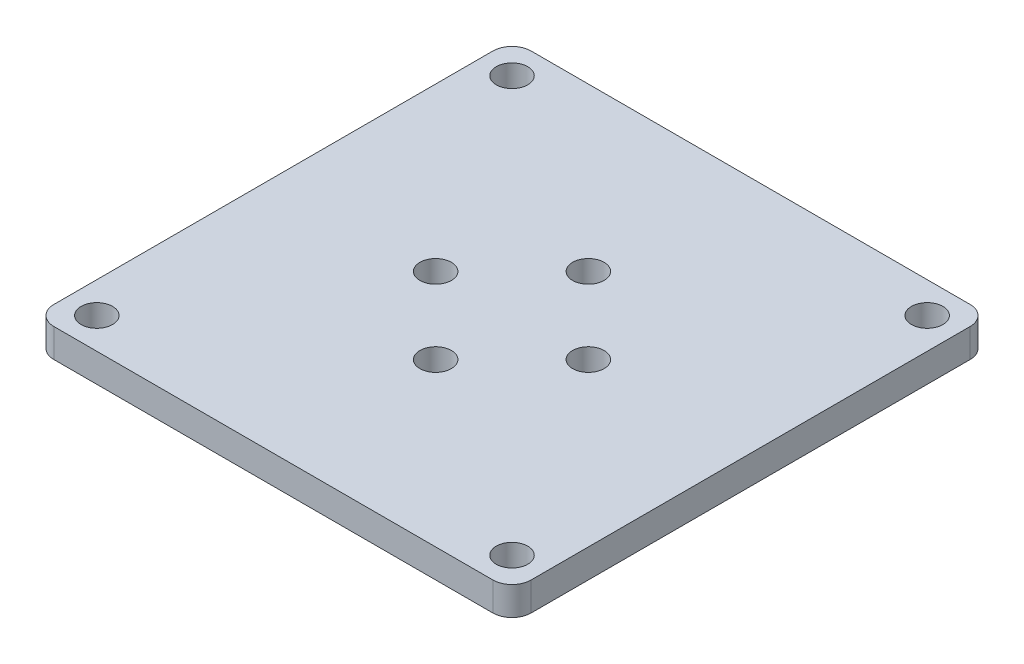
ISO-10303-21;
HEADER;
FILE_DESCRIPTION(('STEP AP214'),'2;1');
FILE_NAME('part.step','',(''),(''),'','','');
FILE_SCHEMA(('AUTOMOTIVE_DESIGN { 1 0 10303 214 1 1 1 1 }'));
ENDSEC;
DATA;
#1=APPLICATION_CONTEXT('core data for automotive mechanical design processes');
#2=APPLICATION_PROTOCOL_DEFINITION('international standard','automotive_design',2000,#1);
#3=PRODUCT_CONTEXT('',#1,'mechanical');
#4=PRODUCT('Part','Part','',(#3));
#5=PRODUCT_RELATED_PRODUCT_CATEGORY('part','',(#4));
#6=PRODUCT_DEFINITION_FORMATION('','',#4);
#7=PRODUCT_DEFINITION_CONTEXT('part definition',#1,'design');
#8=PRODUCT_DEFINITION('design','',#6,#7);
#9=PRODUCT_DEFINITION_SHAPE('','',#8);
#10=(LENGTH_UNIT() NAMED_UNIT(*) SI_UNIT(.MILLI.,.METRE.));
#11=(NAMED_UNIT(*) PLANE_ANGLE_UNIT() SI_UNIT($,.RADIAN.));
#12=(NAMED_UNIT(*) SI_UNIT($,.STERADIAN.) SOLID_ANGLE_UNIT());
#13=UNCERTAINTY_MEASURE_WITH_UNIT(LENGTH_MEASURE(1.E-05),#10,'distance_accuracy_value','');
#14=(GEOMETRIC_REPRESENTATION_CONTEXT(3) GLOBAL_UNCERTAINTY_ASSIGNED_CONTEXT((#13)) GLOBAL_UNIT_ASSIGNED_CONTEXT((#10,
#11,#12)) REPRESENTATION_CONTEXT('',''));
#15=CARTESIAN_POINT('',(0.,0.,0.));
#16=DIRECTION('',(0.,0.,1.));
#17=DIRECTION('',(1.,0.,0.));
#18=AXIS2_PLACEMENT_3D('',#15,#16,#17);
#19=CARTESIAN_POINT('',(0.,3.,0.));
#20=DIRECTION('',(0.,-1.,0.));
#21=DIRECTION('',(0.,0.,-1.));
#22=AXIS2_PLACEMENT_3D('',#19,#20,#21);
#23=PLANE('',#22);
#24=DIRECTION('',(0.,0.,1.));
#25=VECTOR('',#24,1.);
#26=CARTESIAN_POINT('',(-25.,3.,25.));
#27=LINE('',#26,#25);
#28=CARTESIAN_POINT('',(-25.,3.,-23.));
#29=VERTEX_POINT('',#28);
#30=CARTESIAN_POINT('',(-25.,3.,23.));
#31=VERTEX_POINT('',#30);
#32=EDGE_CURVE('E174',#29,#31,#27,.T.);
#33=ORIENTED_EDGE('',*,*,#32,.T.);
#34=CARTESIAN_POINT('',(-23.,3.,23.));
#35=DIRECTION('',(0.,-1.,0.));
#36=DIRECTION('',(0.,0.,-1.));
#37=AXIS2_PLACEMENT_3D('',#34,#35,#36);
#38=CIRCLE('',#37,2.);
#39=CARTESIAN_POINT('',(-23.,3.,25.));
#40=VERTEX_POINT('',#39);
#41=EDGE_CURVE('E11',#31,#40,#38,.F.);
#42=ORIENTED_EDGE('',*,*,#41,.T.);
#43=DIRECTION('',(1.,0.,0.));
#44=VECTOR('',#43,1.);
#45=CARTESIAN_POINT('',(-25.,3.,25.));
#46=LINE('',#45,#44);
#47=CARTESIAN_POINT('',(23.,3.,25.));
#48=VERTEX_POINT('',#47);
#49=EDGE_CURVE('E122',#40,#48,#46,.T.);
#50=ORIENTED_EDGE('',*,*,#49,.T.);
#51=CARTESIAN_POINT('',(23.,3.,23.));
#52=DIRECTION('',(0.,-1.,0.));
#53=DIRECTION('',(0.,0.,-1.));
#54=AXIS2_PLACEMENT_3D('',#51,#52,#53);
#55=CIRCLE('',#54,2.);
#56=CARTESIAN_POINT('',(25.,3.,23.));
#57=VERTEX_POINT('',#56);
#58=EDGE_CURVE('E144',#48,#57,#55,.F.);
#59=ORIENTED_EDGE('',*,*,#58,.T.);
#60=DIRECTION('',(0.,0.,-1.));
#61=VECTOR('',#60,1.);
#62=CARTESIAN_POINT('',(25.,3.,25.));
#63=LINE('',#62,#61);
#64=CARTESIAN_POINT('',(25.,3.,-23.));
#65=VERTEX_POINT('',#64);
#66=EDGE_CURVE('E121',#57,#65,#63,.T.);
#67=ORIENTED_EDGE('',*,*,#66,.T.);
#68=CARTESIAN_POINT('',(23.,3.,-23.));
#69=DIRECTION('',(0.,-1.,0.));
#70=DIRECTION('',(0.,0.,-1.));
#71=AXIS2_PLACEMENT_3D('',#68,#69,#70);
#72=CIRCLE('',#71,2.);
#73=CARTESIAN_POINT('',(23.,3.,-25.));
#74=VERTEX_POINT('',#73);
#75=EDGE_CURVE('E152',#65,#74,#72,.F.);
#76=ORIENTED_EDGE('',*,*,#75,.T.);
#77=DIRECTION('',(-1.,0.,0.));
#78=VECTOR('',#77,1.);
#79=CARTESIAN_POINT('',(-25.,3.,-25.));
#80=LINE('',#79,#78);
#81=CARTESIAN_POINT('',(-23.,3.,-25.));
#82=VERTEX_POINT('',#81);
#83=EDGE_CURVE('E178',#74,#82,#80,.T.);
#84=ORIENTED_EDGE('',*,*,#83,.T.);
#85=CARTESIAN_POINT('',(-23.,3.,-23.));
#86=DIRECTION('',(0.,-1.,0.));
#87=DIRECTION('',(0.,0.,-1.));
#88=AXIS2_PLACEMENT_3D('',#85,#86,#87);
#89=CIRCLE('',#88,2.);
#90=EDGE_CURVE('E161',#82,#29,#89,.F.);
#91=ORIENTED_EDGE('',*,*,#90,.T.);
#92=EDGE_LOOP('',(#33,#42,#50,#59,#67,#76,#84,#91));
#93=FACE_BOUND('',#92,.T.);
#94=CARTESIAN_POINT('',(21.75,3.,-21.75));
#95=DIRECTION('',(0.,1.,0.));
#96=DIRECTION('',(0.,0.,1.));
#97=AXIS2_PLACEMENT_3D('',#94,#95,#96);
#98=CIRCLE('',#97,1.65);
#99=CARTESIAN_POINT('',(21.75,3.,-20.1));
#100=VERTEX_POINT('',#99);
#101=EDGE_CURVE('E129',#100,#100,#98,.T.);
#102=ORIENTED_EDGE('',*,*,#101,.F.);
#103=EDGE_LOOP('',(#102));
#104=FACE_BOUND('',#103,.T.);
#105=CARTESIAN_POINT('',(-21.75,3.,-21.75));
#106=DIRECTION('',(0.,1.,0.));
#107=DIRECTION('',(0.,0.,1.));
#108=AXIS2_PLACEMENT_3D('',#105,#106,#107);
#109=CIRCLE('',#108,1.65);
#110=CARTESIAN_POINT('',(-21.75,3.,-20.1));
#111=VERTEX_POINT('',#110);
#112=EDGE_CURVE('E183',#111,#111,#109,.T.);
#113=ORIENTED_EDGE('',*,*,#112,.F.);
#114=EDGE_LOOP('',(#113));
#115=FACE_BOUND('',#114,.T.);
#116=CARTESIAN_POINT('',(21.75,3.,21.75));
#117=DIRECTION('',(0.,1.,0.));
#118=DIRECTION('',(0.,0.,1.));
#119=AXIS2_PLACEMENT_3D('',#116,#117,#118);
#120=CIRCLE('',#119,1.65);
#121=CARTESIAN_POINT('',(21.75,3.,23.4));
#122=VERTEX_POINT('',#121);
#123=EDGE_CURVE('E188',#122,#122,#120,.T.);
#124=ORIENTED_EDGE('',*,*,#123,.F.);
#125=EDGE_LOOP('',(#124));
#126=FACE_BOUND('',#125,.T.);
#127=CARTESIAN_POINT('',(-21.75,3.,21.75));
#128=DIRECTION('',(0.,1.,0.));
#129=DIRECTION('',(0.,0.,1.));
#130=AXIS2_PLACEMENT_3D('',#127,#128,#129);
#131=CIRCLE('',#130,1.65);
#132=CARTESIAN_POINT('',(-21.75,3.,23.4));
#133=VERTEX_POINT('',#132);
#134=EDGE_CURVE('E194',#133,#133,#131,.T.);
#135=ORIENTED_EDGE('',*,*,#134,.F.);
#136=EDGE_LOOP('',(#135));
#137=FACE_BOUND('',#136,.T.);
#138=CARTESIAN_POINT('',(8.,3.,0.));
#139=DIRECTION('',(0.,1.,0.));
#140=DIRECTION('',(0.,0.,1.));
#141=AXIS2_PLACEMENT_3D('',#138,#139,#140);
#142=CIRCLE('',#141,1.65);
#143=CARTESIAN_POINT('',(8.,3.,1.65));
#144=VERTEX_POINT('',#143);
#145=EDGE_CURVE('E200',#144,#144,#142,.T.);
#146=ORIENTED_EDGE('',*,*,#145,.F.);
#147=EDGE_LOOP('',(#146));
#148=FACE_BOUND('',#147,.T.);
#149=CARTESIAN_POINT('',(0.,3.,-8.));
#150=DIRECTION('',(0.,1.,0.));
#151=DIRECTION('',(0.,0.,1.));
#152=AXIS2_PLACEMENT_3D('',#149,#150,#151);
#153=CIRCLE('',#152,1.65);
#154=CARTESIAN_POINT('',(0.,3.,-6.35));
#155=VERTEX_POINT('',#154);
#156=EDGE_CURVE('E206',#155,#155,#153,.T.);
#157=ORIENTED_EDGE('',*,*,#156,.F.);
#158=EDGE_LOOP('',(#157));
#159=FACE_BOUND('',#158,.T.);
#160=CARTESIAN_POINT('',(-8.,3.,0.));
#161=DIRECTION('',(0.,1.,0.));
#162=DIRECTION('',(0.,0.,1.));
#163=AXIS2_PLACEMENT_3D('',#160,#161,#162);
#164=CIRCLE('',#163,1.65);
#165=CARTESIAN_POINT('',(-8.,3.,1.65));
#166=VERTEX_POINT('',#165);
#167=EDGE_CURVE('E212',#166,#166,#164,.T.);
#168=ORIENTED_EDGE('',*,*,#167,.F.);
#169=EDGE_LOOP('',(#168));
#170=FACE_BOUND('',#169,.T.);
#171=CARTESIAN_POINT('',(0.,3.,8.));
#172=DIRECTION('',(0.,1.,0.));
#173=DIRECTION('',(0.,0.,1.));
#174=AXIS2_PLACEMENT_3D('',#171,#172,#173);
#175=CIRCLE('',#174,1.65);
#176=CARTESIAN_POINT('',(0.,3.,9.65));
#177=VERTEX_POINT('',#176);
#178=EDGE_CURVE('E218',#177,#177,#175,.T.);
#179=ORIENTED_EDGE('',*,*,#178,.F.);
#180=EDGE_LOOP('',(#179));
#181=FACE_BOUND('',#180,.T.);
#182=ADVANCED_FACE('F39',(#93,#104,#115,#126,#137,#148,#159,#170,#181),#23,.F.);
#183=CARTESIAN_POINT('',(0.,0.,0.));
#184=DIRECTION('',(0.,-1.,0.));
#185=DIRECTION('',(0.,0.,-1.));
#186=AXIS2_PLACEMENT_3D('',#183,#184,#185);
#187=PLANE('',#186);
#188=CARTESIAN_POINT('',(-8.,0.,0.));
#189=DIRECTION('',(0.,1.,0.));
#190=DIRECTION('',(0.,0.,1.));
#191=AXIS2_PLACEMENT_3D('',#188,#189,#190);
#192=CIRCLE('',#191,1.65);
#193=CARTESIAN_POINT('',(-8.,0.,1.65));
#194=VERTEX_POINT('',#193);
#195=EDGE_CURVE('E215',#194,#194,#192,.T.);
#196=ORIENTED_EDGE('',*,*,#195,.T.);
#197=EDGE_LOOP('',(#196));
#198=FACE_BOUND('',#197,.T.);
#199=CARTESIAN_POINT('',(8.,0.,0.));
#200=DIRECTION('',(0.,1.,0.));
#201=DIRECTION('',(0.,0.,1.));
#202=AXIS2_PLACEMENT_3D('',#199,#200,#201);
#203=CIRCLE('',#202,1.65);
#204=CARTESIAN_POINT('',(8.,0.,1.65));
#205=VERTEX_POINT('',#204);
#206=EDGE_CURVE('E203',#205,#205,#203,.T.);
#207=ORIENTED_EDGE('',*,*,#206,.T.);
#208=EDGE_LOOP('',(#207));
#209=FACE_BOUND('',#208,.T.);
#210=CARTESIAN_POINT('',(21.75,0.,21.75));
#211=DIRECTION('',(0.,1.,0.));
#212=DIRECTION('',(0.,0.,1.));
#213=AXIS2_PLACEMENT_3D('',#210,#211,#212);
#214=CIRCLE('',#213,1.65);
#215=CARTESIAN_POINT('',(21.75,0.,23.4));
#216=VERTEX_POINT('',#215);
#217=EDGE_CURVE('E191',#216,#216,#214,.T.);
#218=ORIENTED_EDGE('',*,*,#217,.T.);
#219=EDGE_LOOP('',(#218));
#220=FACE_BOUND('',#219,.T.);
#221=CARTESIAN_POINT('',(21.75,0.,-21.75));
#222=DIRECTION('',(0.,1.,0.));
#223=DIRECTION('',(0.,0.,1.));
#224=AXIS2_PLACEMENT_3D('',#221,#222,#223);
#225=CIRCLE('',#224,1.65);
#226=CARTESIAN_POINT('',(21.75,0.,-20.1));
#227=VERTEX_POINT('',#226);
#228=EDGE_CURVE('E135',#227,#227,#225,.T.);
#229=ORIENTED_EDGE('',*,*,#228,.T.);
#230=EDGE_LOOP('',(#229));
#231=FACE_BOUND('',#230,.T.);
#232=DIRECTION('',(1.,0.,0.));
#233=VECTOR('',#232,1.);
#234=CARTESIAN_POINT('',(-25.,0.,25.));
#235=LINE('',#234,#233);
#236=CARTESIAN_POINT('',(-23.,0.,25.));
#237=VERTEX_POINT('',#236);
#238=CARTESIAN_POINT('',(23.,0.,25.));
#239=VERTEX_POINT('',#238);
#240=EDGE_CURVE('E141',#237,#239,#235,.T.);
#241=ORIENTED_EDGE('',*,*,#240,.F.);
#242=CARTESIAN_POINT('',(-23.,0.,23.));
#243=DIRECTION('',(0.,-1.,0.));
#244=DIRECTION('',(0.,0.,-1.));
#245=AXIS2_PLACEMENT_3D('',#242,#243,#244);
#246=CIRCLE('',#245,2.);
#247=CARTESIAN_POINT('',(-25.,0.,23.));
#248=VERTEX_POINT('',#247);
#249=EDGE_CURVE('E61',#237,#248,#246,.T.);
#250=ORIENTED_EDGE('',*,*,#249,.T.);
#251=DIRECTION('',(0.,0.,1.));
#252=VECTOR('',#251,1.);
#253=CARTESIAN_POINT('',(-25.,0.,25.));
#254=LINE('',#253,#252);
#255=CARTESIAN_POINT('',(-25.,0.,-23.));
#256=VERTEX_POINT('',#255);
#257=EDGE_CURVE('E132',#256,#248,#254,.T.);
#258=ORIENTED_EDGE('',*,*,#257,.F.);
#259=CARTESIAN_POINT('',(-23.,0.,-23.));
#260=DIRECTION('',(0.,-1.,0.));
#261=DIRECTION('',(0.,0.,-1.));
#262=AXIS2_PLACEMENT_3D('',#259,#260,#261);
#263=CIRCLE('',#262,2.);
#264=CARTESIAN_POINT('',(-23.,0.,-25.));
#265=VERTEX_POINT('',#264);
#266=EDGE_CURVE('E157',#256,#265,#263,.T.);
#267=ORIENTED_EDGE('',*,*,#266,.T.);
#268=DIRECTION('',(-1.,0.,0.));
#269=VECTOR('',#268,1.);
#270=CARTESIAN_POINT('',(-25.,0.,-25.));
#271=LINE('',#270,#269);
#272=CARTESIAN_POINT('',(23.,0.,-25.));
#273=VERTEX_POINT('',#272);
#274=EDGE_CURVE('E128',#273,#265,#271,.T.);
#275=ORIENTED_EDGE('',*,*,#274,.F.);
#276=CARTESIAN_POINT('',(23.,0.,-23.));
#277=DIRECTION('',(0.,-1.,0.));
#278=DIRECTION('',(0.,0.,-1.));
#279=AXIS2_PLACEMENT_3D('',#276,#277,#278);
#280=CIRCLE('',#279,2.);
#281=CARTESIAN_POINT('',(25.,0.,-23.));
#282=VERTEX_POINT('',#281);
#283=EDGE_CURVE('E127',#273,#282,#280,.T.);
#284=ORIENTED_EDGE('',*,*,#283,.T.);
#285=DIRECTION('',(0.,0.,-1.));
#286=VECTOR('',#285,1.);
#287=CARTESIAN_POINT('',(25.,0.,25.));
#288=LINE('',#287,#286);
#289=CARTESIAN_POINT('',(25.,0.,23.));
#290=VERTEX_POINT('',#289);
#291=EDGE_CURVE('E118',#290,#282,#288,.T.);
#292=ORIENTED_EDGE('',*,*,#291,.F.);
#293=CARTESIAN_POINT('',(23.,0.,23.));
#294=DIRECTION('',(0.,-1.,0.));
#295=DIRECTION('',(0.,0.,-1.));
#296=AXIS2_PLACEMENT_3D('',#293,#294,#295);
#297=CIRCLE('',#296,2.);
#298=EDGE_CURVE('E105',#290,#239,#297,.T.);
#299=ORIENTED_EDGE('',*,*,#298,.T.);
#300=EDGE_LOOP('',(#241,#250,#258,#267,#275,#284,#292,#299));
#301=FACE_BOUND('',#300,.T.);
#302=CARTESIAN_POINT('',(-21.75,0.,-21.75));
#303=DIRECTION('',(0.,1.,0.));
#304=DIRECTION('',(0.,0.,1.));
#305=AXIS2_PLACEMENT_3D('',#302,#303,#304);
#306=CIRCLE('',#305,1.65);
#307=CARTESIAN_POINT('',(-21.75,0.,-20.1));
#308=VERTEX_POINT('',#307);
#309=EDGE_CURVE('E185',#308,#308,#306,.T.);
#310=ORIENTED_EDGE('',*,*,#309,.T.);
#311=EDGE_LOOP('',(#310));
#312=FACE_BOUND('',#311,.T.);
#313=CARTESIAN_POINT('',(-21.75,0.,21.75));
#314=DIRECTION('',(0.,1.,0.));
#315=DIRECTION('',(0.,0.,1.));
#316=AXIS2_PLACEMENT_3D('',#313,#314,#315);
#317=CIRCLE('',#316,1.65);
#318=CARTESIAN_POINT('',(-21.75,0.,23.4));
#319=VERTEX_POINT('',#318);
#320=EDGE_CURVE('E197',#319,#319,#317,.T.);
#321=ORIENTED_EDGE('',*,*,#320,.T.);
#322=EDGE_LOOP('',(#321));
#323=FACE_BOUND('',#322,.T.);
#324=CARTESIAN_POINT('',(0.,0.,-8.));
#325=DIRECTION('',(0.,1.,0.));
#326=DIRECTION('',(0.,0.,1.));
#327=AXIS2_PLACEMENT_3D('',#324,#325,#326);
#328=CIRCLE('',#327,1.65);
#329=CARTESIAN_POINT('',(0.,0.,-6.35));
#330=VERTEX_POINT('',#329);
#331=EDGE_CURVE('E209',#330,#330,#328,.T.);
#332=ORIENTED_EDGE('',*,*,#331,.T.);
#333=EDGE_LOOP('',(#332));
#334=FACE_BOUND('',#333,.T.);
#335=CARTESIAN_POINT('',(0.,0.,8.));
#336=DIRECTION('',(0.,1.,0.));
#337=DIRECTION('',(0.,0.,1.));
#338=AXIS2_PLACEMENT_3D('',#335,#336,#337);
#339=CIRCLE('',#338,1.65);
#340=CARTESIAN_POINT('',(0.,0.,9.65));
#341=VERTEX_POINT('',#340);
#342=EDGE_CURVE('E221',#341,#341,#339,.T.);
#343=ORIENTED_EDGE('',*,*,#342,.T.);
#344=EDGE_LOOP('',(#343));
#345=FACE_BOUND('',#344,.T.);
#346=ADVANCED_FACE('F124',(#198,#209,#220,#231,#301,#312,#323,#334,#345),#187,.T.);
#347=CARTESIAN_POINT('',(25.,3.,25.));
#348=DIRECTION('',(-1.,0.,0.));
#349=DIRECTION('',(0.,0.,1.));
#350=AXIS2_PLACEMENT_3D('',#347,#348,#349);
#351=PLANE('',#350);
#352=ORIENTED_EDGE('',*,*,#291,.T.);
#353=DIRECTION('',(0.,-1.,0.));
#354=VECTOR('',#353,1.);
#355=CARTESIAN_POINT('',(25.,3.,-23.));
#356=LINE('',#355,#354);
#357=EDGE_CURVE('E150',#282,#65,#356,.F.);
#358=ORIENTED_EDGE('',*,*,#357,.T.);
#359=ORIENTED_EDGE('',*,*,#66,.F.);
#360=DIRECTION('',(0.,-1.,0.));
#361=VECTOR('',#360,1.);
#362=CARTESIAN_POINT('',(25.,3.,23.));
#363=LINE('',#362,#361);
#364=EDGE_CURVE('E109',#57,#290,#363,.T.);
#365=ORIENTED_EDGE('',*,*,#364,.T.);
#366=EDGE_LOOP('',(#352,#358,#359,#365));
#367=FACE_BOUND('',#366,.T.);
#368=ADVANCED_FACE('F117',(#367),#351,.F.);
#369=CARTESIAN_POINT('',(-25.,3.,-25.));
#370=DIRECTION('',(0.,0.,1.));
#371=DIRECTION('',(1.,0.,0.));
#372=AXIS2_PLACEMENT_3D('',#369,#370,#371);
#373=PLANE('',#372);
#374=ORIENTED_EDGE('',*,*,#274,.T.);
#375=DIRECTION('',(0.,-1.,0.));
#376=VECTOR('',#375,1.);
#377=CARTESIAN_POINT('',(-23.,3.,-25.));
#378=LINE('',#377,#376);
#379=EDGE_CURVE('E159',#265,#82,#378,.F.);
#380=ORIENTED_EDGE('',*,*,#379,.T.);
#381=ORIENTED_EDGE('',*,*,#83,.F.);
#382=DIRECTION('',(0.,-1.,0.));
#383=VECTOR('',#382,1.);
#384=CARTESIAN_POINT('',(23.,3.,-25.));
#385=LINE('',#384,#383);
#386=EDGE_CURVE('E146',#74,#273,#385,.T.);
#387=ORIENTED_EDGE('',*,*,#386,.T.);
#388=EDGE_LOOP('',(#374,#380,#381,#387));
#389=FACE_BOUND('',#388,.T.);
#390=ADVANCED_FACE('F246',(#389),#373,.F.);
#391=CARTESIAN_POINT('',(-25.,3.,25.));
#392=DIRECTION('',(1.,0.,0.));
#393=DIRECTION('',(0.,0.,-1.));
#394=AXIS2_PLACEMENT_3D('',#391,#392,#393);
#395=PLANE('',#394);
#396=ORIENTED_EDGE('',*,*,#257,.T.);
#397=DIRECTION('',(0.,-1.,0.));
#398=VECTOR('',#397,1.);
#399=CARTESIAN_POINT('',(-25.,3.,23.));
#400=LINE('',#399,#398);
#401=EDGE_CURVE('E47',#248,#31,#400,.F.);
#402=ORIENTED_EDGE('',*,*,#401,.T.);
#403=ORIENTED_EDGE('',*,*,#32,.F.);
#404=DIRECTION('',(0.,-1.,0.));
#405=VECTOR('',#404,1.);
#406=CARTESIAN_POINT('',(-25.,3.,-23.));
#407=LINE('',#406,#405);
#408=EDGE_CURVE('E154',#29,#256,#407,.T.);
#409=ORIENTED_EDGE('',*,*,#408,.T.);
#410=EDGE_LOOP('',(#396,#402,#403,#409));
#411=FACE_BOUND('',#410,.T.);
#412=ADVANCED_FACE('F243',(#411),#395,.F.);
#413=CARTESIAN_POINT('',(-25.,3.,25.));
#414=DIRECTION('',(0.,0.,-1.));
#415=DIRECTION('',(-1.,0.,0.));
#416=AXIS2_PLACEMENT_3D('',#413,#414,#415);
#417=PLANE('',#416);
#418=ORIENTED_EDGE('',*,*,#49,.F.);
#419=DIRECTION('',(0.,-1.,0.));
#420=VECTOR('',#419,1.);
#421=CARTESIAN_POINT('',(-23.,3.,25.));
#422=LINE('',#421,#420);
#423=EDGE_CURVE('E163',#40,#237,#422,.T.);
#424=ORIENTED_EDGE('',*,*,#423,.T.);
#425=ORIENTED_EDGE('',*,*,#240,.T.);
#426=DIRECTION('',(0.,-1.,0.));
#427=VECTOR('',#426,1.);
#428=CARTESIAN_POINT('',(23.,3.,25.));
#429=LINE('',#428,#427);
#430=EDGE_CURVE('E111',#239,#48,#429,.F.);
#431=ORIENTED_EDGE('',*,*,#430,.T.);
#432=EDGE_LOOP('',(#418,#424,#425,#431));
#433=FACE_BOUND('',#432,.T.);
#434=ADVANCED_FACE('F169',(#433),#417,.F.);
#435=CARTESIAN_POINT('',(21.75,3.,-21.75));
#436=DIRECTION('',(0.,-1.,0.));
#437=DIRECTION('',(0.,0.,-1.));
#438=AXIS2_PLACEMENT_3D('',#435,#436,#437);
#439=CYLINDRICAL_SURFACE('',#438,1.65);
#440=ORIENTED_EDGE('',*,*,#101,.T.);
#441=EDGE_LOOP('',(#440));
#442=FACE_BOUND('',#441,.T.);
#443=ORIENTED_EDGE('',*,*,#228,.F.);
#444=EDGE_LOOP('',(#443));
#445=FACE_BOUND('',#444,.T.);
#446=ADVANCED_FACE('F238',(#442,#445),#439,.F.);
#447=CARTESIAN_POINT('',(-21.75,3.,-21.75));
#448=DIRECTION('',(0.,-1.,0.));
#449=DIRECTION('',(0.,0.,-1.));
#450=AXIS2_PLACEMENT_3D('',#447,#448,#449);
#451=CYLINDRICAL_SURFACE('',#450,1.65);
#452=ORIENTED_EDGE('',*,*,#112,.T.);
#453=EDGE_LOOP('',(#452));
#454=FACE_BOUND('',#453,.T.);
#455=ORIENTED_EDGE('',*,*,#309,.F.);
#456=EDGE_LOOP('',(#455));
#457=FACE_BOUND('',#456,.T.);
#458=ADVANCED_FACE('F394',(#454,#457),#451,.F.);
#459=CARTESIAN_POINT('',(21.75,3.,21.75));
#460=DIRECTION('',(0.,-1.,0.));
#461=DIRECTION('',(0.,0.,-1.));
#462=AXIS2_PLACEMENT_3D('',#459,#460,#461);
#463=CYLINDRICAL_SURFACE('',#462,1.65);
#464=ORIENTED_EDGE('',*,*,#123,.T.);
#465=EDGE_LOOP('',(#464));
#466=FACE_BOUND('',#465,.T.);
#467=ORIENTED_EDGE('',*,*,#217,.F.);
#468=EDGE_LOOP('',(#467));
#469=FACE_BOUND('',#468,.T.);
#470=ADVANCED_FACE('F383',(#466,#469),#463,.F.);
#471=CARTESIAN_POINT('',(-21.75,3.,21.75));
#472=DIRECTION('',(0.,-1.,0.));
#473=DIRECTION('',(0.,0.,-1.));
#474=AXIS2_PLACEMENT_3D('',#471,#472,#473);
#475=CYLINDRICAL_SURFACE('',#474,1.65);
#476=ORIENTED_EDGE('',*,*,#134,.T.);
#477=EDGE_LOOP('',(#476));
#478=FACE_BOUND('',#477,.T.);
#479=ORIENTED_EDGE('',*,*,#320,.F.);
#480=EDGE_LOOP('',(#479));
#481=FACE_BOUND('',#480,.T.);
#482=ADVANCED_FACE('F372',(#478,#481),#475,.F.);
#483=CARTESIAN_POINT('',(8.,3.,0.));
#484=DIRECTION('',(0.,-1.,0.));
#485=DIRECTION('',(0.,0.,-1.));
#486=AXIS2_PLACEMENT_3D('',#483,#484,#485);
#487=CYLINDRICAL_SURFACE('',#486,1.65);
#488=ORIENTED_EDGE('',*,*,#145,.T.);
#489=EDGE_LOOP('',(#488));
#490=FACE_BOUND('',#489,.T.);
#491=ORIENTED_EDGE('',*,*,#206,.F.);
#492=EDGE_LOOP('',(#491));
#493=FACE_BOUND('',#492,.T.);
#494=ADVANCED_FACE('F361',(#490,#493),#487,.F.);
#495=CARTESIAN_POINT('',(0.,3.,-8.));
#496=DIRECTION('',(0.,-1.,0.));
#497=DIRECTION('',(0.,0.,-1.));
#498=AXIS2_PLACEMENT_3D('',#495,#496,#497);
#499=CYLINDRICAL_SURFACE('',#498,1.65);
#500=ORIENTED_EDGE('',*,*,#156,.T.);
#501=EDGE_LOOP('',(#500));
#502=FACE_BOUND('',#501,.T.);
#503=ORIENTED_EDGE('',*,*,#331,.F.);
#504=EDGE_LOOP('',(#503));
#505=FACE_BOUND('',#504,.T.);
#506=ADVANCED_FACE('F350',(#502,#505),#499,.F.);
#507=CARTESIAN_POINT('',(-8.,3.,0.));
#508=DIRECTION('',(0.,-1.,0.));
#509=DIRECTION('',(0.,0.,-1.));
#510=AXIS2_PLACEMENT_3D('',#507,#508,#509);
#511=CYLINDRICAL_SURFACE('',#510,1.65);
#512=ORIENTED_EDGE('',*,*,#167,.T.);
#513=EDGE_LOOP('',(#512));
#514=FACE_BOUND('',#513,.T.);
#515=ORIENTED_EDGE('',*,*,#195,.F.);
#516=EDGE_LOOP('',(#515));
#517=FACE_BOUND('',#516,.T.);
#518=ADVANCED_FACE('F340',(#514,#517),#511,.F.);
#519=CARTESIAN_POINT('',(0.,3.,8.));
#520=DIRECTION('',(0.,-1.,0.));
#521=DIRECTION('',(0.,0.,-1.));
#522=AXIS2_PLACEMENT_3D('',#519,#520,#521);
#523=CYLINDRICAL_SURFACE('',#522,1.65);
#524=ORIENTED_EDGE('',*,*,#178,.T.);
#525=EDGE_LOOP('',(#524));
#526=FACE_BOUND('',#525,.T.);
#527=ORIENTED_EDGE('',*,*,#342,.F.);
#528=EDGE_LOOP('',(#527));
#529=FACE_BOUND('',#528,.T.);
#530=ADVANCED_FACE('F227',(#526,#529),#523,.F.);
#531=CARTESIAN_POINT('',(23.,3.,23.));
#532=DIRECTION('',(0.,-1.,0.));
#533=DIRECTION('',(0.,0.,-1.));
#534=AXIS2_PLACEMENT_3D('',#531,#532,#533);
#535=CYLINDRICAL_SURFACE('',#534,2.);
#536=ORIENTED_EDGE('',*,*,#58,.F.);
#537=ORIENTED_EDGE('',*,*,#430,.F.);
#538=ORIENTED_EDGE('',*,*,#298,.F.);
#539=ORIENTED_EDGE('',*,*,#364,.F.);
#540=EDGE_LOOP('',(#536,#537,#538,#539));
#541=FACE_BOUND('',#540,.T.);
#542=ADVANCED_FACE('F108',(#541),#535,.T.);
#543=CARTESIAN_POINT('',(23.,3.,-23.));
#544=DIRECTION('',(0.,-1.,0.));
#545=DIRECTION('',(0.,0.,-1.));
#546=AXIS2_PLACEMENT_3D('',#543,#544,#545);
#547=CYLINDRICAL_SURFACE('',#546,2.);
#548=ORIENTED_EDGE('',*,*,#75,.F.);
#549=ORIENTED_EDGE('',*,*,#357,.F.);
#550=ORIENTED_EDGE('',*,*,#283,.F.);
#551=ORIENTED_EDGE('',*,*,#386,.F.);
#552=EDGE_LOOP('',(#548,#549,#550,#551));
#553=FACE_BOUND('',#552,.T.);
#554=ADVANCED_FACE('F254',(#553),#547,.T.);
#555=CARTESIAN_POINT('',(-23.,3.,-23.));
#556=DIRECTION('',(0.,-1.,0.));
#557=DIRECTION('',(0.,0.,-1.));
#558=AXIS2_PLACEMENT_3D('',#555,#556,#557);
#559=CYLINDRICAL_SURFACE('',#558,2.);
#560=ORIENTED_EDGE('',*,*,#90,.F.);
#561=ORIENTED_EDGE('',*,*,#379,.F.);
#562=ORIENTED_EDGE('',*,*,#266,.F.);
#563=ORIENTED_EDGE('',*,*,#408,.F.);
#564=EDGE_LOOP('',(#560,#561,#562,#563));
#565=FACE_BOUND('',#564,.T.);
#566=ADVANCED_FACE('F256',(#565),#559,.T.);
#567=CARTESIAN_POINT('',(-23.,3.,23.));
#568=DIRECTION('',(0.,-1.,0.));
#569=DIRECTION('',(0.,0.,-1.));
#570=AXIS2_PLACEMENT_3D('',#567,#568,#569);
#571=CYLINDRICAL_SURFACE('',#570,2.);
#572=ORIENTED_EDGE('',*,*,#41,.F.);
#573=ORIENTED_EDGE('',*,*,#401,.F.);
#574=ORIENTED_EDGE('',*,*,#249,.F.);
#575=ORIENTED_EDGE('',*,*,#423,.F.);
#576=EDGE_LOOP('',(#572,#573,#574,#575));
#577=FACE_BOUND('',#576,.T.);
#578=ADVANCED_FACE('F41',(#577),#571,.T.);
#579=CLOSED_SHELL('',(#182,#346,#368,#390,#412,#434,#446,#458,#470,#482,#494,#506,#518,#530,
#542,#554,#566,#578));
#580=MANIFOLD_SOLID_BREP('B2',#579);
#581=ADVANCED_BREP_SHAPE_REPRESENTATION('',(#18,#580),#14);
#582=SHAPE_DEFINITION_REPRESENTATION(#9,#581);
ENDSEC;
END-ISO-10303-21;
